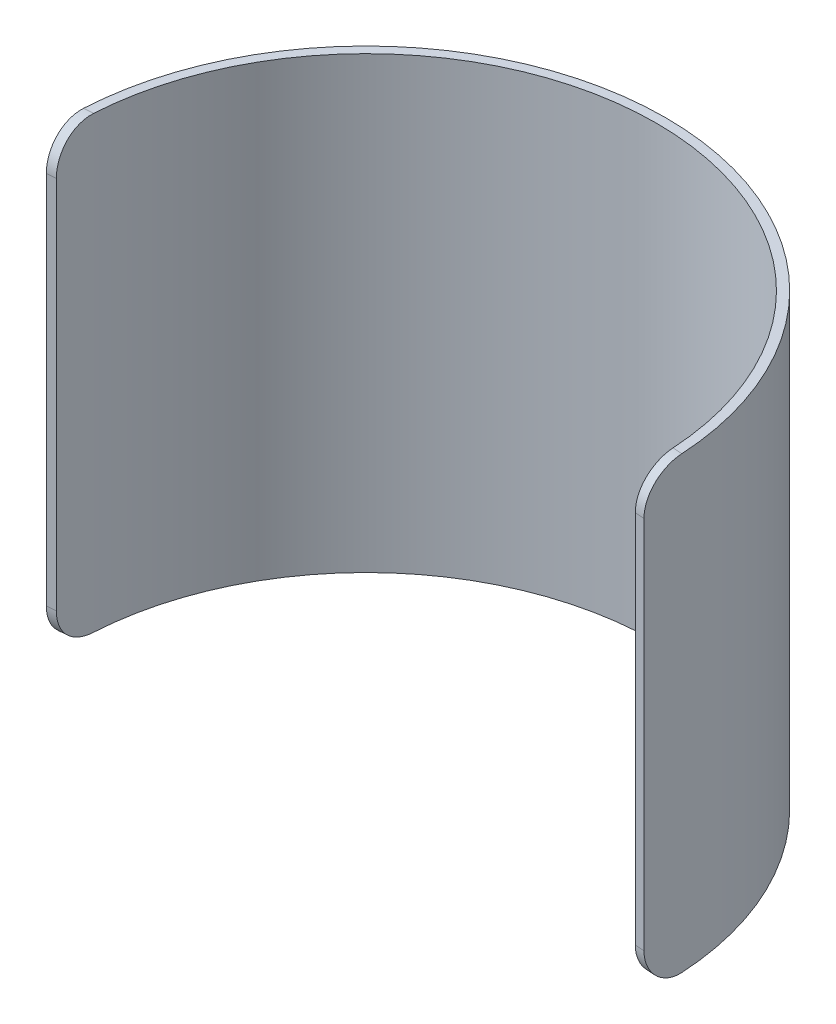
ISO-10303-21;
HEADER;
FILE_DESCRIPTION(('STEP AP214'),'2;1');
FILE_NAME('part.step','',(''),(''),'','','');
FILE_SCHEMA(('AUTOMOTIVE_DESIGN { 1 0 10303 214 1 1 1 1 }'));
ENDSEC;
DATA;
#1=APPLICATION_CONTEXT('core data for automotive mechanical design processes');
#2=APPLICATION_PROTOCOL_DEFINITION('international standard','automotive_design',2000,#1);
#3=PRODUCT_CONTEXT('',#1,'mechanical');
#4=PRODUCT('Part','Part','',(#3));
#5=PRODUCT_RELATED_PRODUCT_CATEGORY('part','',(#4));
#6=PRODUCT_DEFINITION_FORMATION('','',#4);
#7=PRODUCT_DEFINITION_CONTEXT('part definition',#1,'design');
#8=PRODUCT_DEFINITION('design','',#6,#7);
#9=PRODUCT_DEFINITION_SHAPE('','',#8);
#10=(LENGTH_UNIT() NAMED_UNIT(*) SI_UNIT(.MILLI.,.METRE.));
#11=(NAMED_UNIT(*) PLANE_ANGLE_UNIT() SI_UNIT($,.RADIAN.));
#12=(NAMED_UNIT(*) SI_UNIT($,.STERADIAN.) SOLID_ANGLE_UNIT());
#13=UNCERTAINTY_MEASURE_WITH_UNIT(LENGTH_MEASURE(1.E-05),#10,'distance_accuracy_value','');
#14=(GEOMETRIC_REPRESENTATION_CONTEXT(3) GLOBAL_UNCERTAINTY_ASSIGNED_CONTEXT((#13)) GLOBAL_UNIT_ASSIGNED_CONTEXT((#10,
#11,#12)) REPRESENTATION_CONTEXT('',''));
#15=CARTESIAN_POINT('',(0.,0.,0.));
#16=DIRECTION('',(0.,0.,1.));
#17=DIRECTION('',(1.,0.,0.));
#18=AXIS2_PLACEMENT_3D('',#15,#16,#17);
#19=CARTESIAN_POINT('',(0.,152.4,0.));
#20=DIRECTION('',(0.,1.,0.));
#21=DIRECTION('',(0.,0.,1.));
#22=AXIS2_PLACEMENT_3D('',#19,#20,#21);
#23=PLANE('',#22);
#24=CARTESIAN_POINT('',(0.,152.4,0.));
#25=DIRECTION('',(0.,1.,0.));
#26=DIRECTION('',(0.,0.,1.));
#27=AXIS2_PLACEMENT_3D('',#24,#25,#26);
#28=CIRCLE('',#27,98.425);
#29=CARTESIAN_POINT('',(98.2503591938578,152.4,-5.86067771489928));
#30=VERTEX_POINT('',#29);
#31=CARTESIAN_POINT('',(-98.2503591938578,152.4,-5.86067771489928));
#32=VERTEX_POINT('',#31);
#33=EDGE_CURVE('E216',#30,#32,#28,.T.);
#34=ORIENTED_EDGE('',*,*,#33,.F.);
#35=DIRECTION('',(0.997564050259824,0.,0.0697564737441289));
#36=VECTOR('',#35,1.);
#37=CARTESIAN_POINT('',(102.238414722949,152.4,-5.58180570589627));
#38=LINE('',#37,#36);
#39=CARTESIAN_POINT('',(101.443480822077,152.4,-5.63739289929006));
#40=VERTEX_POINT('',#39);
#41=EDGE_CURVE('E219',#30,#40,#38,.T.);
#42=ORIENTED_EDGE('',*,*,#41,.T.);
#43=CARTESIAN_POINT('',(0.,152.4,0.));
#44=DIRECTION('',(0.,1.,0.));
#45=DIRECTION('',(0.,0.,1.));
#46=AXIS2_PLACEMENT_3D('',#43,#44,#45);
#47=CIRCLE('',#46,101.6);
#48=CARTESIAN_POINT('',(-101.443480822077,152.4,-5.63739289929006));
#49=VERTEX_POINT('',#48);
#50=EDGE_CURVE('E105',#40,#49,#47,.T.);
#51=ORIENTED_EDGE('',*,*,#50,.T.);
#52=DIRECTION('',(-0.997564050259824,0.,0.0697564737441289));
#53=VECTOR('',#52,1.);
#54=CARTESIAN_POINT('',(-0.885907216550437,152.4,-12.6690634382998));
#55=LINE('',#54,#53);
#56=EDGE_CURVE('E218',#49,#32,#55,.F.);
#57=ORIENTED_EDGE('',*,*,#56,.T.);
#58=EDGE_LOOP('',(#34,#42,#51,#57));
#59=FACE_BOUND('',#58,.T.);
#60=ADVANCED_FACE('F34',(#59),#23,.T.);
#61=CARTESIAN_POINT('',(0.,0.,0.));
#62=DIRECTION('',(0.,1.,0.));
#63=DIRECTION('',(0.,0.,1.));
#64=AXIS2_PLACEMENT_3D('',#61,#62,#63);
#65=PLANE('',#64);
#66=CARTESIAN_POINT('',(0.,0.,0.));
#67=DIRECTION('',(0.,1.,0.));
#68=DIRECTION('',(0.,0.,1.));
#69=AXIS2_PLACEMENT_3D('',#66,#67,#68);
#70=CIRCLE('',#69,101.6);
#71=CARTESIAN_POINT('',(101.443480822077,0.,-5.63739289929006));
#72=VERTEX_POINT('',#71);
#73=CARTESIAN_POINT('',(-101.443480822077,0.,-5.63739289929006));
#74=VERTEX_POINT('',#73);
#75=EDGE_CURVE('E130',#72,#74,#70,.T.);
#76=ORIENTED_EDGE('',*,*,#75,.F.);
#77=DIRECTION('',(0.997564050259824,0.,0.0697564737441289));
#78=VECTOR('',#77,1.);
#79=CARTESIAN_POINT('',(0.885907216550437,0.,-12.6690634382998));
#80=LINE('',#79,#78);
#81=CARTESIAN_POINT('',(98.2503591938578,0.,-5.86067771489928));
#82=VERTEX_POINT('',#81);
#83=EDGE_CURVE('E205',#72,#82,#80,.F.);
#84=ORIENTED_EDGE('',*,*,#83,.T.);
#85=CARTESIAN_POINT('',(0.,0.,0.));
#86=DIRECTION('',(0.,1.,0.));
#87=DIRECTION('',(0.,0.,1.));
#88=AXIS2_PLACEMENT_3D('',#85,#86,#87);
#89=CIRCLE('',#88,98.425);
#90=CARTESIAN_POINT('',(-98.2503591938578,0.,-5.86067771489928));
#91=VERTEX_POINT('',#90);
#92=EDGE_CURVE('E230',#82,#91,#89,.T.);
#93=ORIENTED_EDGE('',*,*,#92,.T.);
#94=DIRECTION('',(-0.997564050259824,0.,0.0697564737441289));
#95=VECTOR('',#94,1.);
#96=CARTESIAN_POINT('',(-102.238414722949,0.,-5.58180570589627));
#97=LINE('',#96,#95);
#98=EDGE_CURVE('E206',#91,#74,#97,.T.);
#99=ORIENTED_EDGE('',*,*,#98,.T.);
#100=EDGE_LOOP('',(#76,#84,#93,#99));
#101=FACE_BOUND('',#100,.T.);
#102=ADVANCED_FACE('F149',(#101),#65,.F.);
#103=CARTESIAN_POINT('',(0.,152.4,0.));
#104=DIRECTION('',(0.,-1.,0.));
#105=DIRECTION('',(0.,0.,-1.));
#106=AXIS2_PLACEMENT_3D('',#103,#104,#105);
#107=CYLINDRICAL_SURFACE('',#106,101.6);
#108=DIRECTION('',(0.,-1.,0.));
#109=VECTOR('',#108,1.);
#110=CARTESIAN_POINT('',(101.352507506398,152.4,7.0872577324035));
#111=LINE('',#110,#109);
#112=CARTESIAN_POINT('',(101.352507506398,139.7,7.0872577324035));
#113=VERTEX_POINT('',#112);
#114=CARTESIAN_POINT('',(101.352507506398,12.7,7.0872577324035));
#115=VERTEX_POINT('',#114);
#116=EDGE_CURVE('E103',#113,#115,#111,.T.);
#117=ORIENTED_EDGE('',*,*,#116,.T.);
#118=CARTESIAN_POINT('',(101.352507506398,12.7,7.0872577324035));
#119=CARTESIAN_POINT('',(101.352490680105,12.3428542882449,7.08729503529065));
#120=CARTESIAN_POINT('',(101.353557853474,11.985714085304,7.07223068436697));
#121=CARTESIAN_POINT('',(101.357738604548,11.2739879187407,7.0121680785598));
#122=CARTESIAN_POINT('',(101.360852085439,10.919401835081,6.96717123982882));
#123=CARTESIAN_POINT('',(101.369000908904,10.2155493111487,6.84755659702856));
#124=CARTESIAN_POINT('',(101.374034849857,9.86627918396397,6.77296039407448));
#125=CARTESIAN_POINT('',(101.385789336181,9.17527848563763,6.59467575024479));
#126=CARTESIAN_POINT('',(101.392509860944,8.83354782242539,6.49098766484648));
#127=CARTESIAN_POINT('',(101.407330688748,8.15988224967677,6.25517540473336));
#128=CARTESIAN_POINT('',(101.415431675931,7.82795229342995,6.12303712180545));
#129=CARTESIAN_POINT('',(101.432625869236,7.17642765201856,5.83127382370409));
#130=CARTESIAN_POINT('',(101.441719074595,6.85683295738289,5.67164882963567));
#131=CARTESIAN_POINT('',(101.460450835278,6.23230746572462,5.32605301537648));
#132=CARTESIAN_POINT('',(101.470089298308,5.92737420311919,5.14008664586343));
#133=CARTESIAN_POINT('',(101.489421043065,5.33428916670621,4.74308905799297));
#134=CARTESIAN_POINT('',(101.499114324457,5.04613729051289,4.53205799258293));
#135=CARTESIAN_POINT('',(101.518026386225,4.48885370995175,4.08656009304685));
#136=CARTESIAN_POINT('',(101.52724547585,4.21970956562703,3.8521088339271));
#137=CARTESIAN_POINT('',(101.544679270725,3.70215041659224,3.36130781304117));
#138=CARTESIAN_POINT('',(101.55289397125,3.45373550939266,3.10495794827526));
#139=CARTESIAN_POINT('',(101.567785695279,2.97937401639505,2.57214446746383));
#140=CARTESIAN_POINT('',(101.574462504866,2.75343055879064,2.29567806029541));
#141=CARTESIAN_POINT('',(101.585762448801,2.32566107270109,1.72464490901472));
#142=CARTESIAN_POINT('',(101.590385618321,2.12383463119704,1.43007847500752));
#143=CARTESIAN_POINT('',(101.597092624483,1.74620384667425,0.825733138629047));
#144=CARTESIAN_POINT('',(101.599182925293,1.57033427160592,0.515995069276028));
#145=CARTESIAN_POINT('',(101.600425660314,1.24522177409894,-0.117158431350999));
#146=CARTESIAN_POINT('',(101.599578070693,1.09597906766028,-0.440573973551788));
#147=CARTESIAN_POINT('',(101.594592131139,0.825185062014446,-1.09864532448757));
#148=CARTESIAN_POINT('',(101.59045500717,0.703623468139017,-1.43329690121105));
#149=CARTESIAN_POINT('',(101.578625080404,0.488946823865096,-2.11140284865902));
#150=CARTESIAN_POINT('',(101.570933088515,0.395825293997394,-2.45485519495734));
#151=CARTESIAN_POINT('',(101.548526079264,0.211667645672751,-3.26695272091827));
#152=CARTESIAN_POINT('',(101.532309232997,0.132223190701024,-3.73826465716464));
#153=CARTESIAN_POINT('',(101.502830200809,0.0528595630697317,-4.4487994877028));
#154=CARTESIAN_POINT('',(101.49215277868,0.0330388430153574,-4.68609667339186));
#155=CARTESIAN_POINT('',(101.469092342687,0.00660909240616868,-5.1613892389719));
#156=CARTESIAN_POINT('',(101.456709001795,2.59882486769085E-06,-5.39938474415));
#157=CARTESIAN_POINT('',(101.443480822077,0.,-5.63739289929006));
#158=B_SPLINE_CURVE_WITH_KNOTS('',3,(#118,#119,#120,#121,#122,#123,#124,#125,#126,#127,#128,
#129,#130,#131,#132,#133,#134,#135,#136,#137,#138,#139,#140,#141,#142,#143,#144,#145,#146,#147,
#148,#149,#150,#151,#152,#153,#154,#155,#156,#157),.UNSPECIFIED.,.F.,.F.,(4,2,2,2,2,2,2,2,2,2,2,
2,2,2,2,2,2,2,2,4),(0.,1.07111020816662,2.14216974404938,3.21244907217265,4.2827153229907,
5.35351353725703,6.42431092933953,7.49492761324909,8.56553776448015,9.63544061443253,
10.7053484969323,11.7754051107428,12.8454433965412,13.9127450320036,14.9800553251362,
16.046968032514,17.1136374846756,18.5448903135323,19.2596666782446,19.9745802583073),.UNSPECIFIED.);
#159=EDGE_CURVE('E110',#115,#72,#158,.T.);
#160=ORIENTED_EDGE('',*,*,#159,.T.);
#161=ORIENTED_EDGE('',*,*,#75,.T.);
#162=CARTESIAN_POINT('',(-101.443480822077,0.,-5.63739289929006));
#163=CARTESIAN_POINT('',(-101.463304318896,-3.90699616587755E-05,-5.28101074959956));
#164=CARTESIAN_POINT('',(-101.481213332903,0.0148106830776188,-4.92451825425865));
#165=CARTESIAN_POINT('',(-101.513196800821,0.074129536180851,-4.21383249727284));
#166=CARTESIAN_POINT('',(-101.527271244402,0.118598716041852,-3.85963924182487));
#167=CARTESIAN_POINT('',(-101.551572059362,0.236960078646543,-3.15629990412807));
#168=CARTESIAN_POINT('',(-101.561800897827,0.310833334839864,-2.80715072467401));
#169=CARTESIAN_POINT('',(-101.578546584507,0.487560313892051,-2.11618399513467));
#170=CARTESIAN_POINT('',(-101.585063538039,0.590413214398702,-1.77436623730259));
#171=CARTESIAN_POINT('',(-101.594601989376,0.824537940703687,-1.1002670048774));
#172=CARTESIAN_POINT('',(-101.597620866012,0.955830989879833,-0.76799286305087));
#173=CARTESIAN_POINT('',(-101.600457773882,1.24591140651749,-0.115656989504349));
#174=CARTESIAN_POINT('',(-101.600275811019,1.40469872327216,0.204404764737246));
#175=CARTESIAN_POINT('',(-101.597091723552,1.7486306286575,0.829919660992591));
#176=CARTESIAN_POINT('',(-101.594090304819,1.93376861037426,1.13537643934838));
#177=CARTESIAN_POINT('',(-101.585712185619,2.32913188764384,1.72955985099313));
#178=CARTESIAN_POINT('',(-101.580335507065,2.53935695174613,2.01828663859454));
#179=CARTESIAN_POINT('',(-101.567724800087,2.9824972312108,2.57579592301462));
#180=CARTESIAN_POINT('',(-101.560498455684,3.21531615904722,2.84465513918335));
#181=CARTESIAN_POINT('',(-101.544695038223,3.70271642910939,3.3618233956809));
#182=CARTESIAN_POINT('',(-101.5361179615,3.95729783036745,3.61013238026213));
#183=CARTESIAN_POINT('',(-101.518142112432,4.48648109668225,4.08450639764464));
#184=CARTESIAN_POINT('',(-101.508743152751,4.7610875237537,4.31056633402938));
#185=CARTESIAN_POINT('',(-101.489653582352,5.32832092290328,4.73879402899634));
#186=CARTESIAN_POINT('',(-101.479962975238,5.62094767222651,4.94096208282352));
#187=CARTESIAN_POINT('',(-101.460779690977,6.22274010109522,5.32037147042847));
#188=CARTESIAN_POINT('',(-101.451287434448,6.53193677555242,5.49756366760063));
#189=CARTESIAN_POINT('',(-101.432995354641,7.16415217256715,5.82532453211956));
#190=CARTESIAN_POINT('',(-101.424195538585,7.48717103924592,5.97589292178118));
#191=CARTESIAN_POINT('',(-101.407716649044,8.14461215627838,6.24930230321614));
#192=CARTESIAN_POINT('',(-101.400037082344,8.47902930777346,6.3721555103583));
#193=CARTESIAN_POINT('',(-101.386154787376,9.15689093835958,6.58934081551106));
#194=CARTESIAN_POINT('',(-101.379951723254,9.50033334472592,6.68367940098559));
#195=CARTESIAN_POINT('',(-101.367456788158,10.3148192585114,6.87099739083214));
#196=CARTESIAN_POINT('',(-101.361884613855,10.7886918880943,6.95208875834735));
#197=CARTESIAN_POINT('',(-101.356277830897,11.503484430598,7.03317504777538));
#198=CARTESIAN_POINT('',(-101.354867502864,11.7422849412292,7.05344533059619));
#199=CARTESIAN_POINT('',(-101.352981299351,12.2207027107994,7.08048667541715));
#200=CARTESIAN_POINT('',(-101.352505618409,12.4603201293771,7.08725492707371));
#201=CARTESIAN_POINT('',(-101.352507506398,12.7,7.0872577324035));
#202=B_SPLINE_CURVE_WITH_KNOTS('',3,(#162,#163,#164,#165,#166,#167,#168,#169,#170,#171,#172,
#173,#174,#175,#176,#177,#178,#179,#180,#181,#182,#183,#184,#185,#186,#187,#188,#189,#190,#191,
#192,#193,#194,#195,#196,#197,#198,#199,#200,#201),.UNSPECIFIED.,.F.,.F.,(4,2,2,2,2,2,2,2,2,2,2,
2,2,2,2,2,2,2,2,4),(0.,1.07049125834571,2.14098540069004,3.21079160842633,4.28056746144515,
5.3511443988178,6.421719361779,7.4920263703266,8.56232350510861,9.62824452152937,
10.6941684294305,11.7603359347369,12.8264902634545,13.894713673364,14.9629482241407,
16.0307110304491,17.0982307230337,18.5370921201497,19.2557615180968,19.9745804859318),.UNSPECIFIED.);
#203=CARTESIAN_POINT('',(-101.352507506398,12.7,7.0872577324035));
#204=VERTEX_POINT('',#203);
#205=EDGE_CURVE('E111',#74,#204,#202,.T.);
#206=ORIENTED_EDGE('',*,*,#205,.T.);
#207=DIRECTION('',(0.,-1.,0.));
#208=VECTOR('',#207,1.);
#209=CARTESIAN_POINT('',(-101.352507506398,152.4,7.0872577324035));
#210=LINE('',#209,#208);
#211=CARTESIAN_POINT('',(-101.352507506398,139.7,7.0872577324035));
#212=VERTEX_POINT('',#211);
#213=EDGE_CURVE('E121',#212,#204,#210,.T.);
#214=ORIENTED_EDGE('',*,*,#213,.F.);
#215=CARTESIAN_POINT('',(-101.352507506398,139.7,7.0872577324035));
#216=CARTESIAN_POINT('',(-101.352490680105,140.057145711755,7.08729503529065));
#217=CARTESIAN_POINT('',(-101.353557853474,140.414285914696,7.07223068436697));
#218=CARTESIAN_POINT('',(-101.357738604548,141.126012081259,7.01216807855981));
#219=CARTESIAN_POINT('',(-101.360852085439,141.480598164919,6.96717123982883));
#220=CARTESIAN_POINT('',(-101.369000908904,142.184450688851,6.84755659702856));
#221=CARTESIAN_POINT('',(-101.374034849857,142.533720816036,6.77296039407447));
#222=CARTESIAN_POINT('',(-101.385789336181,143.224721514362,6.59467575024479));
#223=CARTESIAN_POINT('',(-101.392509860944,143.566452177575,6.49098766484647));
#224=CARTESIAN_POINT('',(-101.407330688748,144.240117750323,6.25517540473335));
#225=CARTESIAN_POINT('',(-101.415431675931,144.57204770657,6.12303712180544));
#226=CARTESIAN_POINT('',(-101.432625869236,145.223572347982,5.83127382370407));
#227=CARTESIAN_POINT('',(-101.441719074595,145.543167042617,5.67164882963565));
#228=CARTESIAN_POINT('',(-101.460450835278,146.167692534275,5.32605301537646));
#229=CARTESIAN_POINT('',(-101.470089298308,146.472625796881,5.1400866458634));
#230=CARTESIAN_POINT('',(-101.489421043065,147.065710833294,4.74308905799295));
#231=CARTESIAN_POINT('',(-101.499114324457,147.353862709487,4.53205799258292));
#232=CARTESIAN_POINT('',(-101.518026386225,147.911146290048,4.08656009304684));
#233=CARTESIAN_POINT('',(-101.52724547585,148.180290434373,3.85210883392709));
#234=CARTESIAN_POINT('',(-101.544679270725,148.697849583408,3.36130781304116));
#235=CARTESIAN_POINT('',(-101.55289397125,148.946264490607,3.10495794827525));
#236=CARTESIAN_POINT('',(-101.567785695279,149.420625983605,2.57214446746383));
#237=CARTESIAN_POINT('',(-101.574462504866,149.646569441209,2.29567806029541));
#238=CARTESIAN_POINT('',(-101.585762448801,150.074338927299,1.72464490901472));
#239=CARTESIAN_POINT('',(-101.590385618321,150.276165368803,1.43007847500752));
#240=CARTESIAN_POINT('',(-101.597092624483,150.653796153326,0.825733138629045));
#241=CARTESIAN_POINT('',(-101.599182925293,150.829665728394,0.515995069276019));
#242=CARTESIAN_POINT('',(-101.600425660314,151.154778225901,-0.117158431351008));
#243=CARTESIAN_POINT('',(-101.599578070693,151.30402093234,-0.440573973551791));
#244=CARTESIAN_POINT('',(-101.594592131139,151.574814937986,-1.09864532448757));
#245=CARTESIAN_POINT('',(-101.59045500717,151.696376531861,-1.43329690121105));
#246=CARTESIAN_POINT('',(-101.578625080404,151.911053176135,-2.11140284865902));
#247=CARTESIAN_POINT('',(-101.570933088515,152.004174706003,-2.45485519495734));
#248=CARTESIAN_POINT('',(-101.548526079264,152.188332354327,-3.26695272091826));
#249=CARTESIAN_POINT('',(-101.532309232997,152.267776809299,-3.73826465716463));
#250=CARTESIAN_POINT('',(-101.502830200809,152.34714043693,-4.44879948770279));
#251=CARTESIAN_POINT('',(-101.49215277868,152.366961156985,-4.68609667339186));
#252=CARTESIAN_POINT('',(-101.469092342687,152.393390907594,-5.1613892389719));
#253=CARTESIAN_POINT('',(-101.456709001795,152.399997401175,-5.39938474414999));
#254=CARTESIAN_POINT('',(-101.443480822077,152.4,-5.63739289929005));
#255=B_SPLINE_CURVE_WITH_KNOTS('',3,(#215,#216,#217,#218,#219,#220,#221,#222,#223,#224,#225,
#226,#227,#228,#229,#230,#231,#232,#233,#234,#235,#236,#237,#238,#239,#240,#241,#242,#243,#244,
#245,#246,#247,#248,#249,#250,#251,#252,#253,#254),.UNSPECIFIED.,.F.,.F.,(4,2,2,2,2,2,2,2,2,2,2,
2,2,2,2,2,2,2,2,4),(0.,1.0711102081666,2.14216974404937,3.21244907217264,4.28271532299071,
5.35351353725708,6.42431092933958,7.49492761324913,8.56553776448018,9.63544061443257,
10.7053484969324,11.7754051107428,12.8454433965412,13.9127450320037,14.9800553251362,
16.046968032514,17.1136374846756,18.5448903135323,19.2596666782446,19.9745802583073),.UNSPECIFIED.);
#256=EDGE_CURVE('E128',#212,#49,#255,.T.);
#257=ORIENTED_EDGE('',*,*,#256,.T.);
#258=ORIENTED_EDGE('',*,*,#50,.F.);
#259=CARTESIAN_POINT('',(101.443480822077,152.4,-5.63739289929006));
#260=CARTESIAN_POINT('',(101.463304318896,152.400039069962,-5.28101074959956));
#261=CARTESIAN_POINT('',(101.481213332903,152.385189316922,-4.92451825425864));
#262=CARTESIAN_POINT('',(101.513196800821,152.325870463819,-4.21383249727284));
#263=CARTESIAN_POINT('',(101.527271244402,152.281401283958,-3.85963924182487));
#264=CARTESIAN_POINT('',(101.551572059362,152.163039921353,-3.15629990412808));
#265=CARTESIAN_POINT('',(101.561800897827,152.08916666516,-2.80715072467401));
#266=CARTESIAN_POINT('',(101.578546584507,151.912439686108,-2.11618399513467));
#267=CARTESIAN_POINT('',(101.585063538039,151.809586785601,-1.77436623730259));
#268=CARTESIAN_POINT('',(101.594601989376,151.575462059296,-1.10026700487741));
#269=CARTESIAN_POINT('',(101.597620866012,151.44416901012,-0.767992863050881));
#270=CARTESIAN_POINT('',(101.600457773882,151.154088593483,-0.115656989504361));
#271=CARTESIAN_POINT('',(101.600275811019,150.995301276728,0.204404764737237));
#272=CARTESIAN_POINT('',(101.597091723552,150.651369371343,0.829919660992586));
#273=CARTESIAN_POINT('',(101.594090304819,150.466231389626,1.13537643934838));
#274=CARTESIAN_POINT('',(101.585712185619,150.070868112356,1.72955985099312));
#275=CARTESIAN_POINT('',(101.580335507065,149.860643048254,2.01828663859453));
#276=CARTESIAN_POINT('',(101.567724800087,149.417502768789,2.57579592301461));
#277=CARTESIAN_POINT('',(101.560498455684,149.184683840953,2.84465513918334));
#278=CARTESIAN_POINT('',(101.544695038223,148.697283570891,3.3618233956809));
#279=CARTESIAN_POINT('',(101.5361179615,148.442702169633,3.61013238026213));
#280=CARTESIAN_POINT('',(101.518142112432,147.913518903318,4.08450639764463));
#281=CARTESIAN_POINT('',(101.508743152751,147.638912476246,4.31056633402937));
#282=CARTESIAN_POINT('',(101.489653582352,147.071679077097,4.73879402899633));
#283=CARTESIAN_POINT('',(101.479962975238,146.779052327774,4.94096208282351));
#284=CARTESIAN_POINT('',(101.460779690977,146.177259898905,5.32037147042846));
#285=CARTESIAN_POINT('',(101.451287434449,145.868063224448,5.4975636676006));
#286=CARTESIAN_POINT('',(101.432995354641,145.235847827433,5.82532453211953));
#287=CARTESIAN_POINT('',(101.424195538585,144.912828960754,5.97589292178116));
#288=CARTESIAN_POINT('',(101.407716649044,144.255387843722,6.24930230321613));
#289=CARTESIAN_POINT('',(101.400037082344,143.920970692227,6.37215551035828));
#290=CARTESIAN_POINT('',(101.386154787376,143.24310906164,6.58934081551104));
#291=CARTESIAN_POINT('',(101.379951723254,142.899666655274,6.68367940098559));
#292=CARTESIAN_POINT('',(101.367456788158,142.085180741489,6.87099739083214));
#293=CARTESIAN_POINT('',(101.361884613855,141.611308111906,6.95208875834734));
#294=CARTESIAN_POINT('',(101.356277830897,140.896515569402,7.03317504777537));
#295=CARTESIAN_POINT('',(101.354867502864,140.657715058771,7.05344533059619));
#296=CARTESIAN_POINT('',(101.352981299351,140.179297289201,7.08048667541715));
#297=CARTESIAN_POINT('',(101.352505618409,139.939679870623,7.08725492707371));
#298=CARTESIAN_POINT('',(101.352507506398,139.7,7.0872577324035));
#299=B_SPLINE_CURVE_WITH_KNOTS('',3,(#259,#260,#261,#262,#263,#264,#265,#266,#267,#268,#269,
#270,#271,#272,#273,#274,#275,#276,#277,#278,#279,#280,#281,#282,#283,#284,#285,#286,#287,#288,
#289,#290,#291,#292,#293,#294,#295,#296,#297,#298),.UNSPECIFIED.,.F.,.F.,(4,2,2,2,2,2,2,2,2,2,2,
2,2,2,2,2,2,2,2,4),(0.,1.07049125834571,2.14098540069004,3.21079160842633,4.28056746144515,
5.3511443988178,6.42171936177899,7.4920263703266,8.56232350510861,9.62824452152936,
10.6941684294305,11.7603359347369,12.8264902634545,13.894713673364,14.9629482241406,
16.030711030449,17.0982307230336,18.5370921201497,19.2557615180967,19.9745804859318),.UNSPECIFIED.);
#300=EDGE_CURVE('E100',#40,#113,#299,.T.);
#301=ORIENTED_EDGE('',*,*,#300,.T.);
#302=EDGE_LOOP('',(#117,#160,#161,#206,#214,#257,#258,#301));
#303=FACE_BOUND('',#302,.T.);
#304=ADVANCED_FACE('F102',(#303),#107,.T.);
#305=CARTESIAN_POINT('',(0.,152.4,0.));
#306=DIRECTION('',(0.,-1.,0.));
#307=DIRECTION('',(0.,0.,-1.));
#308=AXIS2_PLACEMENT_3D('',#305,#306,#307);
#309=CYLINDRICAL_SURFACE('',#308,98.425);
#310=ORIENTED_EDGE('',*,*,#92,.F.);
#311=CARTESIAN_POINT('',(98.2503591938578,0.,-5.86067771489928));
#312=CARTESIAN_POINT('',(98.2716308233536,-3.91093085133092E-05,-5.50439656803708));
#313=CARTESIAN_POINT('',(98.2909269510806,0.0147938229523329,-5.14799301866223));
#314=CARTESIAN_POINT('',(98.3255565945146,0.0740532115325287,-4.43745940439692));
#315=CARTESIAN_POINT('',(98.3408900865399,0.118479844705895,-4.08332935310582));
#316=CARTESIAN_POINT('',(98.3675741186761,0.236738504906596,-3.38008874609603));
#317=CARTESIAN_POINT('',(98.3789271823774,0.310551837143321,-3.03097514510127));
#318=CARTESIAN_POINT('',(98.397785142794,0.487147996476996,-2.34005701861028));
#319=CARTESIAN_POINT('',(98.4052901527148,0.589929971210156,-1.99825227837885));
#320=CARTESIAN_POINT('',(98.4166703097868,0.823909417289744,-1.32415344801447));
#321=CARTESIAN_POINT('',(98.4205426725783,0.955128590571261,-0.991866842165383));
#322=CARTESIAN_POINT('',(98.4249550867022,1.24506101072475,-0.339490325326483));
#323=CARTESIAN_POINT('',(98.4254951446418,1.40377420308057,-0.019400390154197));
#324=CARTESIAN_POINT('',(98.4236303000176,1.74755961828267,0.60618115834339));
#325=CARTESIAN_POINT('',(98.42122614934,1.93262510066762,0.911676478115676));
#326=CARTESIAN_POINT('',(98.4139272257001,2.32784740037096,1.50594545793268));
#327=CARTESIAN_POINT('',(98.409032476336,2.53800397993725,1.79471927638442));
#328=CARTESIAN_POINT('',(98.3972812314928,2.98095338495553,2.35225384152861));
#329=CARTESIAN_POINT('',(98.3904333710454,3.21364365844952,2.62109625772409));
#330=CARTESIAN_POINT('',(98.3752965633528,3.7007805031426,3.1382460124255));
#331=CARTESIAN_POINT('',(98.3670076124466,3.95522712961217,3.38655329876023));
#332=CARTESIAN_POINT('',(98.3495304510153,4.48413665479742,3.86093953816896));
#333=CARTESIAN_POINT('',(98.3403420338055,4.75860415031862,4.08701335826672));
#334=CARTESIAN_POINT('',(98.3216089674565,5.32555668006728,4.51528449633962));
#335=CARTESIAN_POINT('',(98.3120643226516,5.61804149510237,4.71748210469709));
#336=CARTESIAN_POINT('',(98.293120435601,6.21958180458951,5.09698815098505));
#337=CARTESIAN_POINT('',(98.2837215318525,6.52867006564111,5.27424467308844));
#338=CARTESIAN_POINT('',(98.2655767012571,7.16067202600492,5.60214554144259));
#339=CARTESIAN_POINT('',(98.2568307813325,7.48358587182836,5.75278960559147));
#340=CARTESIAN_POINT('',(98.2404314863995,8.14082240561022,6.02636237006174));
#341=CARTESIAN_POINT('',(98.232777632727,8.47514001506937,6.14930322676119));
#342=CARTESIAN_POINT('',(98.2189283095058,9.15280880297289,6.36667585659108));
#343=CARTESIAN_POINT('',(98.2127325095371,9.49615791507815,6.4611140902768));
#344=CARTESIAN_POINT('',(98.2002302524855,10.3112273061243,6.64886280622892));
#345=CARTESIAN_POINT('',(98.1946446408134,10.7858015949544,6.73020050762315));
#346=CARTESIAN_POINT('',(98.1890230506216,11.5016667040202,6.81153345765535));
#347=CARTESIAN_POINT('',(98.1876086789198,11.7408286015235,6.83186548730636));
#348=CARTESIAN_POINT('',(98.1857168966193,12.2199726310511,6.85898921119962));
#349=CARTESIAN_POINT('',(98.1852396806995,12.4599549231296,6.86577809207525));
#350=CARTESIAN_POINT('',(98.1852416468232,12.7,6.86578092826589));
#351=B_SPLINE_CURVE_WITH_KNOTS('',3,(#311,#312,#313,#314,#315,#316,#317,#318,#319,#320,#321,
#322,#323,#324,#325,#326,#327,#328,#329,#330,#331,#332,#333,#334,#335,#336,#337,#338,#339,#340,
#341,#342,#343,#344,#345,#346,#347,#348,#349,#350),.UNSPECIFIED.,.F.,.F.,(4,2,2,2,2,2,2,2,2,2,2,
2,2,2,2,2,2,2,2,4),(0.,1.07044008433151,2.14088656574489,3.21065315190168,4.28038826488448,
5.35094264250374,6.42149489741285,7.49177381376064,8.56204258942546,9.62765098882553,
10.6932620954086,11.759118641864,12.8249622240439,13.8929925797138,14.9610342562207,
16.0286063512956,17.0959362827863,18.536980633544,19.2567446136961,19.9766580974238),.UNSPECIFIED.);
#352=CARTESIAN_POINT('',(98.1852416468232,12.7,6.86578092826589));
#353=VERTEX_POINT('',#352);
#354=EDGE_CURVE('E180',#82,#353,#351,.T.);
#355=ORIENTED_EDGE('',*,*,#354,.T.);
#356=DIRECTION('',(0.,-1.,0.));
#357=VECTOR('',#356,1.);
#358=CARTESIAN_POINT('',(98.1852416468232,152.4,6.86578092826589));
#359=LINE('',#358,#357);
#360=CARTESIAN_POINT('',(98.1852416468232,139.7,6.86578092826589));
#361=VERTEX_POINT('',#360);
#362=EDGE_CURVE('E122',#361,#353,#359,.T.);
#363=ORIENTED_EDGE('',*,*,#362,.F.);
#364=CARTESIAN_POINT('',(98.1852416468232,139.7,6.86578092826589));
#365=CARTESIAN_POINT('',(98.1852243648159,140.05714209242,6.86581819772521));
#366=CARTESIAN_POINT('',(98.1862919582897,140.414278676536,6.85075418373783));
#367=CARTESIAN_POINT('',(98.1904720077305,141.125997697805,6.79069274974572));
#368=CARTESIAN_POINT('',(98.1935843670445,141.480580254884,6.74569674457799));
#369=CARTESIAN_POINT('',(98.2017261223854,142.184426503838,6.62608391747099));
#370=CARTESIAN_POINT('',(98.206754123709,142.533693873553,6.55148864395411));
#371=CARTESIAN_POINT('',(98.2184855478379,143.224689234939,6.37320555031407));
#372=CARTESIAN_POINT('',(98.2251889501698,143.566417318684,6.2695180856947));
#373=CARTESIAN_POINT('',(98.2399559854041,144.240078126247,6.03370610232214));
#374=CARTESIAN_POINT('',(98.2480202936046,144.572005890479,5.90156745672457));
#375=CARTESIAN_POINT('',(98.2651112686217,145.223526201824,5.60980186392919));
#376=CARTESIAN_POINT('',(98.2741379346373,145.543118759205,5.45017493961369));
#377=CARTESIAN_POINT('',(98.2926949630539,146.167639931772,5.1045730241156));
#378=CARTESIAN_POINT('',(98.3022252403582,146.472571007827,4.91860247542327));
#379=CARTESIAN_POINT('',(98.3212860498772,147.0656511266,4.52159391564326));
#380=CARTESIAN_POINT('',(98.3308165820901,147.353800272496,4.31055605869962));
#381=CARTESIAN_POINT('',(98.3493347861753,147.911065461489,3.86505142988611));
#382=CARTESIAN_POINT('',(98.3583228351092,148.180194747403,3.63060123914824));
#383=CARTESIAN_POINT('',(98.3752130442336,148.697724422635,3.13980202893722));
#384=CARTESIAN_POINT('',(98.3831151993612,148.946124715301,2.883452907368));
#385=CARTESIAN_POINT('',(98.3972871364018,149.420456046222,2.35064267881173));
#386=CARTESIAN_POINT('',(98.4035566978446,149.64638404721,2.07417886192117));
#387=CARTESIAN_POINT('',(98.4139353928516,150.074122947987,1.50315354240798));
#388=CARTESIAN_POINT('',(98.4180445636671,150.275934263571,1.2085923519339));
#389=CARTESIAN_POINT('',(98.423607176832,150.653501905117,0.604317152858117));
#390=CARTESIAN_POINT('',(98.425067858117,150.829328041156,0.294646830426163));
#391=CARTESIAN_POINT('',(98.4249272887234,151.154366239042,-0.33835834499224));
#392=CARTESIAN_POINT('',(98.4233260131565,151.303578084552,-0.661693309026404));
#393=CARTESIAN_POINT('',(98.4167029789701,151.574327120856,-1.31959072821589));
#394=CARTESIAN_POINT('',(98.4116824726579,151.695874422166,-1.6541490301394));
#395=CARTESIAN_POINT('',(98.3979532231811,151.910542496443,-2.33205182015105));
#396=CARTESIAN_POINT('',(98.3892453181986,152.003669721301,-2.67539429485537));
#397=CARTESIAN_POINT('',(98.3642823069932,152.188018633304,-3.48786709735798));
#398=CARTESIAN_POINT('',(98.3464619220411,152.267585657099,-3.95967404439393));
#399=CARTESIAN_POINT('',(98.3143912013297,152.347066893383,-4.67093096901616));
#400=CARTESIAN_POINT('',(98.3028194261352,152.366915778448,-4.90846499317322));
#401=CARTESIAN_POINT('',(98.2779097449619,152.393382282413,-5.38422263297493));
#402=CARTESIAN_POINT('',(98.2645715030197,152.399997380522,-5.62244637134459));
#403=CARTESIAN_POINT('',(98.2503591938578,152.4,-5.86067771489929));
#404=B_SPLINE_CURVE_WITH_KNOTS('',3,(#364,#365,#366,#367,#368,#369,#370,#371,#372,#373,#374,
#375,#376,#377,#378,#379,#380,#381,#382,#383,#384,#385,#386,#387,#388,#389,#390,#391,#392,#393,
#394,#395,#396,#397,#398,#399,#400,#401,#402,#403),.UNSPECIFIED.,.F.,.F.,(4,2,2,2,2,2,2,2,2,2,2,
2,2,2,2,2,2,2,2,4),(0.,1.07109936064243,2.14214809574103,3.21241852812662,4.28267588247975,
5.35346588149903,6.42425498915549,7.49486373743671,8.56546590266439,9.63531514992617,
10.7051693852558,11.7751680219463,12.8451482081806,13.9121994566448,14.9792593783256,
16.0459286948862,17.1123556770104,18.545291608452,19.2609066093636,19.9766579086765),.UNSPECIFIED.);
#405=EDGE_CURVE('E126',#361,#30,#404,.T.);
#406=ORIENTED_EDGE('',*,*,#405,.T.);
#407=ORIENTED_EDGE('',*,*,#33,.T.);
#408=CARTESIAN_POINT('',(-98.2503591938578,152.4,-5.86067771489928));
#409=CARTESIAN_POINT('',(-98.2716308233536,152.400039109309,-5.50439656803708));
#410=CARTESIAN_POINT('',(-98.2909269510806,152.385206177048,-5.14799301866222));
#411=CARTESIAN_POINT('',(-98.3255565945146,152.325946788467,-4.43745940439692));
#412=CARTESIAN_POINT('',(-98.3408900865399,152.281520155294,-4.08332935310582));
#413=CARTESIAN_POINT('',(-98.3675741186761,152.163261495093,-3.38008874609603));
#414=CARTESIAN_POINT('',(-98.3789271823774,152.089448162857,-3.03097514510127));
#415=CARTESIAN_POINT('',(-98.397785142794,151.912852003523,-2.34005701861028));
#416=CARTESIAN_POINT('',(-98.4052901527148,151.81007002879,-1.99825227837885));
#417=CARTESIAN_POINT('',(-98.4166703097868,151.57609058271,-1.32415344801447));
#418=CARTESIAN_POINT('',(-98.4205426725783,151.444871409429,-0.991866842165384));
#419=CARTESIAN_POINT('',(-98.4249550867022,151.154938989275,-0.339490325326486));
#420=CARTESIAN_POINT('',(-98.4254951446418,150.996225796919,-0.0194003901542007));
#421=CARTESIAN_POINT('',(-98.4236303000176,150.652440381717,0.606181158343387));
#422=CARTESIAN_POINT('',(-98.42122614934,150.467374899332,0.911676478115673));
#423=CARTESIAN_POINT('',(-98.4139272257001,150.072152599629,1.50594545793267));
#424=CARTESIAN_POINT('',(-98.409032476336,149.861996020063,1.79471927638441));
#425=CARTESIAN_POINT('',(-98.3972812314928,149.419046615044,2.3522538415286));
#426=CARTESIAN_POINT('',(-98.3904333710454,149.18635634155,2.62109625772408));
#427=CARTESIAN_POINT('',(-98.3752965633528,148.699219496857,3.13824601242548));
#428=CARTESIAN_POINT('',(-98.3670076124466,148.444772870388,3.38655329876021));
#429=CARTESIAN_POINT('',(-98.3495304510153,147.915863345203,3.86093953816894));
#430=CARTESIAN_POINT('',(-98.3403420338055,147.641395849681,4.0870133582667));
#431=CARTESIAN_POINT('',(-98.3216089674565,147.074443319933,4.51528449633962));
#432=CARTESIAN_POINT('',(-98.3120643226516,146.781958504898,4.71748210469709));
#433=CARTESIAN_POINT('',(-98.293120435601,146.180418195411,5.09698815098505));
#434=CARTESIAN_POINT('',(-98.2837215318525,145.871329934359,5.27424467308844));
#435=CARTESIAN_POINT('',(-98.2655767012571,145.239327973995,5.6021455414426));
#436=CARTESIAN_POINT('',(-98.2568307813325,144.916414128172,5.75278960559148));
#437=CARTESIAN_POINT('',(-98.2404314863995,144.25917759439,6.02636237006174));
#438=CARTESIAN_POINT('',(-98.232777632727,143.924859984931,6.1493032267612));
#439=CARTESIAN_POINT('',(-98.2189283095058,143.247191197027,6.36667585659108));
#440=CARTESIAN_POINT('',(-98.2127325095371,142.903842084922,6.4611140902768));
#441=CARTESIAN_POINT('',(-98.2002302524855,142.088772693876,6.64886280622892));
#442=CARTESIAN_POINT('',(-98.1946446408134,141.614198405046,6.73020050762315));
#443=CARTESIAN_POINT('',(-98.1890230506216,140.89833329598,6.81153345765535));
#444=CARTESIAN_POINT('',(-98.1876086789198,140.659171398477,6.83186548730637));
#445=CARTESIAN_POINT('',(-98.1857168966193,140.180027368949,6.85898921119962));
#446=CARTESIAN_POINT('',(-98.1852396806995,139.94004507687,6.86577809207526));
#447=CARTESIAN_POINT('',(-98.1852416468232,139.7,6.86578092826589));
#448=B_SPLINE_CURVE_WITH_KNOTS('',3,(#408,#409,#410,#411,#412,#413,#414,#415,#416,#417,#418,
#419,#420,#421,#422,#423,#424,#425,#426,#427,#428,#429,#430,#431,#432,#433,#434,#435,#436,#437,
#438,#439,#440,#441,#442,#443,#444,#445,#446,#447),.UNSPECIFIED.,.F.,.F.,(4,2,2,2,2,2,2,2,2,2,2,
2,2,2,2,2,2,2,2,4),(0.,1.07044008433151,2.14088656574489,3.21065315190169,4.28038826488447,
5.35094264250374,6.42149489741285,7.49177381376063,8.56204258942545,9.62765098882551,
10.6932620954085,11.759118641864,12.8249622240439,13.8929925797138,14.9610342562207,
16.0286063512956,17.0959362827863,18.536980633544,19.2567446136961,19.9766580974238),.UNSPECIFIED.);
#449=CARTESIAN_POINT('',(-98.1852416468232,139.7,6.86578092826589));
#450=VERTEX_POINT('',#449);
#451=EDGE_CURVE('E55',#32,#450,#448,.T.);
#452=ORIENTED_EDGE('',*,*,#451,.T.);
#453=DIRECTION('',(0.,-1.,0.));
#454=VECTOR('',#453,1.);
#455=CARTESIAN_POINT('',(-98.1852416468232,152.4,6.86578092826589));
#456=LINE('',#455,#454);
#457=CARTESIAN_POINT('',(-98.1852416468232,12.7,6.86578092826589));
#458=VERTEX_POINT('',#457);
#459=EDGE_CURVE('E227',#450,#458,#456,.T.);
#460=ORIENTED_EDGE('',*,*,#459,.T.);
#461=CARTESIAN_POINT('',(-98.1852416468232,12.7,6.86578092826589));
#462=CARTESIAN_POINT('',(-98.1852243648159,12.3428579075801,6.86581819772521));
#463=CARTESIAN_POINT('',(-98.1862919582897,11.9857213234644,6.85075418373783));
#464=CARTESIAN_POINT('',(-98.1904720077305,11.2740023021945,6.79069274974572));
#465=CARTESIAN_POINT('',(-98.1935843670445,10.9194197451164,6.74569674457798));
#466=CARTESIAN_POINT('',(-98.2017261223854,10.2155734961624,6.62608391747099));
#467=CARTESIAN_POINT('',(-98.206754123709,9.86630612644713,6.55148864395411));
#468=CARTESIAN_POINT('',(-98.2184855478379,9.17531076506125,6.37320555031407));
#469=CARTESIAN_POINT('',(-98.2251889501698,8.83358268131634,6.26951808569469));
#470=CARTESIAN_POINT('',(-98.2399559854041,8.15992187375309,6.03370610232214));
#471=CARTESIAN_POINT('',(-98.2480202936046,7.82799410952093,5.90156745672457));
#472=CARTESIAN_POINT('',(-98.2651112686217,7.17647379817601,5.60980186392919));
#473=CARTESIAN_POINT('',(-98.2741379346373,6.85688124079523,5.45017493961369));
#474=CARTESIAN_POINT('',(-98.2926949630539,6.23236006822754,5.1045730241156));
#475=CARTESIAN_POINT('',(-98.3022252403582,5.92742899217274,4.91860247542328));
#476=CARTESIAN_POINT('',(-98.3212860498772,5.3343488734004,4.52159391564327));
#477=CARTESIAN_POINT('',(-98.3308165820901,5.04619972750354,4.31055605869964));
#478=CARTESIAN_POINT('',(-98.3493347861753,4.48893453851084,3.86505142988612));
#479=CARTESIAN_POINT('',(-98.3583228351092,4.21980525259698,3.63060123914824));
#480=CARTESIAN_POINT('',(-98.3752130442336,3.70227557736466,3.13980202893721));
#481=CARTESIAN_POINT('',(-98.3831151993612,3.45387528469851,2.883452907368));
#482=CARTESIAN_POINT('',(-98.3972871364018,2.97954395377806,2.35064267881174));
#483=CARTESIAN_POINT('',(-98.4035566978446,2.75361595279014,2.07417886192117));
#484=CARTESIAN_POINT('',(-98.4139353928516,2.3258770520129,1.50315354240798));
#485=CARTESIAN_POINT('',(-98.4180445636671,2.12406573642901,1.2085923519339));
#486=CARTESIAN_POINT('',(-98.423607176832,1.74649809488343,0.604317152858122));
#487=CARTESIAN_POINT('',(-98.425067858117,1.57067195884383,0.294646830426169));
#488=CARTESIAN_POINT('',(-98.4249272887234,1.24563376095795,-0.338358344992234));
#489=CARTESIAN_POINT('',(-98.4233260131565,1.09642191544806,-0.6616933090264));
#490=CARTESIAN_POINT('',(-98.4167029789701,0.825672879144177,-1.31959072821588));
#491=CARTESIAN_POINT('',(-98.4116824726579,0.704125577833668,-1.65414903013939));
#492=CARTESIAN_POINT('',(-98.3979532231811,0.489457503557069,-2.33205182015104));
#493=CARTESIAN_POINT('',(-98.3892453181986,0.396330278699304,-2.67539429485536));
#494=CARTESIAN_POINT('',(-98.3642823069932,0.211981366696289,-3.48786709735797));
#495=CARTESIAN_POINT('',(-98.3464619220411,0.132414342900946,-3.95967404439393));
#496=CARTESIAN_POINT('',(-98.3143912013297,0.0529331066174801,-4.67093096901616));
#497=CARTESIAN_POINT('',(-98.3028194261352,0.0330842215520186,-4.90846499317322));
#498=CARTESIAN_POINT('',(-98.2779097449619,0.00661771758677096,-5.38422263297492));
#499=CARTESIAN_POINT('',(-98.2645715030197,2.61947776959428E-06,-5.62244637134459));
#500=CARTESIAN_POINT('',(-98.2503591938578,0.,-5.86067771489928));
#501=B_SPLINE_CURVE_WITH_KNOTS('',3,(#461,#462,#463,#464,#465,#466,#467,#468,#469,#470,#471,
#472,#473,#474,#475,#476,#477,#478,#479,#480,#481,#482,#483,#484,#485,#486,#487,#488,#489,#490,
#491,#492,#493,#494,#495,#496,#497,#498,#499,#500),.UNSPECIFIED.,.F.,.F.,(4,2,2,2,2,2,2,2,2,2,2,
2,2,2,2,2,2,2,2,4),(0.,1.07109936064244,2.14214809574102,3.21241852812663,4.28267588247975,
5.35346588149904,6.42425498915548,7.49486373743671,8.56546590266437,9.63531514992617,
10.7051693852558,11.7751680219463,12.8451482081806,13.9121994566448,14.9792593783256,
16.0459286948862,17.1123556770104,18.545291608452,19.2609066093636,19.9766579086765),.UNSPECIFIED.);
#502=EDGE_CURVE('E181',#458,#91,#501,.T.);
#503=ORIENTED_EDGE('',*,*,#502,.T.);
#504=EDGE_LOOP('',(#310,#355,#363,#406,#407,#452,#460,#503));
#505=FACE_BOUND('',#504,.T.);
#506=ADVANCED_FACE('F148',(#505),#309,.F.);
#507=CARTESIAN_POINT('',(0.,152.4,0.));
#508=DIRECTION('',(0.0697564737441289,0.,-0.997564050259824));
#509=DIRECTION('',(-0.997564050259824,0.,-0.0697564737441289));
#510=AXIS2_PLACEMENT_3D('',#507,#508,#509);
#511=PLANE('',#510);
#512=ORIENTED_EDGE('',*,*,#362,.T.);
#513=DIRECTION('',(0.997564050259824,0.,0.0697564737441289));
#514=VECTOR('',#513,1.);
#515=CARTESIAN_POINT('',(0.,12.7,0.));
#516=LINE('',#515,#514);
#517=EDGE_CURVE('E120',#353,#115,#516,.T.);
#518=ORIENTED_EDGE('',*,*,#517,.T.);
#519=ORIENTED_EDGE('',*,*,#116,.F.);
#520=DIRECTION('',(0.997564050259824,0.,0.0697564737441289));
#521=VECTOR('',#520,1.);
#522=CARTESIAN_POINT('',(98.1852416468232,139.7,6.86578092826589));
#523=LINE('',#522,#521);
#524=EDGE_CURVE('E117',#113,#361,#523,.F.);
#525=ORIENTED_EDGE('',*,*,#524,.T.);
#526=EDGE_LOOP('',(#512,#518,#519,#525));
#527=FACE_BOUND('',#526,.T.);
#528=ADVANCED_FACE('F116',(#527),#511,.F.);
#529=CARTESIAN_POINT('',(0.,152.4,0.));
#530=DIRECTION('',(0.0697564737441289,0.,0.997564050259824));
#531=DIRECTION('',(0.997564050259824,0.,-0.0697564737441289));
#532=AXIS2_PLACEMENT_3D('',#529,#530,#531);
#533=PLANE('',#532);
#534=ORIENTED_EDGE('',*,*,#213,.T.);
#535=DIRECTION('',(-0.997564050259824,0.,0.0697564737441289));
#536=VECTOR('',#535,1.);
#537=CARTESIAN_POINT('',(-98.1852416468232,12.7,6.86578092826589));
#538=LINE('',#537,#536);
#539=EDGE_CURVE('E11',#204,#458,#538,.F.);
#540=ORIENTED_EDGE('',*,*,#539,.T.);
#541=ORIENTED_EDGE('',*,*,#459,.F.);
#542=DIRECTION('',(-0.997564050259824,0.,0.0697564737441289));
#543=VECTOR('',#542,1.);
#544=CARTESIAN_POINT('',(0.,139.7,0.));
#545=LINE('',#544,#543);
#546=EDGE_CURVE('E43',#450,#212,#545,.T.);
#547=ORIENTED_EDGE('',*,*,#546,.T.);
#548=EDGE_LOOP('',(#534,#540,#541,#547));
#549=FACE_BOUND('',#548,.T.);
#550=ADVANCED_FACE('F195',(#549),#533,.T.);
#551=CARTESIAN_POINT('',(0.885907216550437,12.7,-12.6690634382998));
#552=DIRECTION('',(0.997564050259824,0.,0.0697564737441289));
#553=DIRECTION('',(0.0697564737441289,0.,-0.997564050259824));
#554=AXIS2_PLACEMENT_3D('',#551,#552,#553);
#555=CYLINDRICAL_SURFACE('',#554,12.7);
#556=ORIENTED_EDGE('',*,*,#354,.F.);
#557=ORIENTED_EDGE('',*,*,#83,.F.);
#558=ORIENTED_EDGE('',*,*,#159,.F.);
#559=ORIENTED_EDGE('',*,*,#517,.F.);
#560=EDGE_LOOP('',(#556,#557,#558,#559));
#561=FACE_BOUND('',#560,.T.);
#562=ADVANCED_FACE('F151',(#561),#555,.T.);
#563=CARTESIAN_POINT('',(0.885907216550437,139.7,-12.6690634382998));
#564=DIRECTION('',(-0.997564050259824,0.,-0.0697564737441289));
#565=DIRECTION('',(-0.0697564737441289,0.,0.997564050259824));
#566=AXIS2_PLACEMENT_3D('',#563,#564,#565);
#567=CYLINDRICAL_SURFACE('',#566,12.7);
#568=ORIENTED_EDGE('',*,*,#405,.F.);
#569=ORIENTED_EDGE('',*,*,#524,.F.);
#570=ORIENTED_EDGE('',*,*,#300,.F.);
#571=ORIENTED_EDGE('',*,*,#41,.F.);
#572=EDGE_LOOP('',(#568,#569,#570,#571));
#573=FACE_BOUND('',#572,.T.);
#574=ADVANCED_FACE('F125',(#573),#567,.T.);
#575=CARTESIAN_POINT('',(-0.885907216550437,12.7,-12.6690634382998));
#576=DIRECTION('',(0.997564050259824,0.,-0.0697564737441289));
#577=DIRECTION('',(-0.0697564737441289,0.,-0.997564050259824));
#578=AXIS2_PLACEMENT_3D('',#575,#576,#577);
#579=CYLINDRICAL_SURFACE('',#578,12.7);
#580=ORIENTED_EDGE('',*,*,#502,.F.);
#581=ORIENTED_EDGE('',*,*,#539,.F.);
#582=ORIENTED_EDGE('',*,*,#205,.F.);
#583=ORIENTED_EDGE('',*,*,#98,.F.);
#584=EDGE_LOOP('',(#580,#581,#582,#583));
#585=FACE_BOUND('',#584,.T.);
#586=ADVANCED_FACE('F169',(#585),#579,.T.);
#587=CARTESIAN_POINT('',(-0.885907216550437,139.7,-12.6690634382998));
#588=DIRECTION('',(-0.997564050259824,0.,0.0697564737441289));
#589=DIRECTION('',(0.0697564737441289,0.,0.997564050259824));
#590=AXIS2_PLACEMENT_3D('',#587,#588,#589);
#591=CYLINDRICAL_SURFACE('',#590,12.7);
#592=ORIENTED_EDGE('',*,*,#451,.F.);
#593=ORIENTED_EDGE('',*,*,#56,.F.);
#594=ORIENTED_EDGE('',*,*,#256,.F.);
#595=ORIENTED_EDGE('',*,*,#546,.F.);
#596=EDGE_LOOP('',(#592,#593,#594,#595));
#597=FACE_BOUND('',#596,.T.);
#598=ADVANCED_FACE('F36',(#597),#591,.T.);
#599=CLOSED_SHELL('',(#60,#102,#304,#506,#528,#550,#562,#574,#586,#598));
#600=MANIFOLD_SOLID_BREP('B2',#599);
#601=ADVANCED_BREP_SHAPE_REPRESENTATION('',(#18,#600),#14);
#602=SHAPE_DEFINITION_REPRESENTATION(#9,#601);
ENDSEC;
END-ISO-10303-21;
